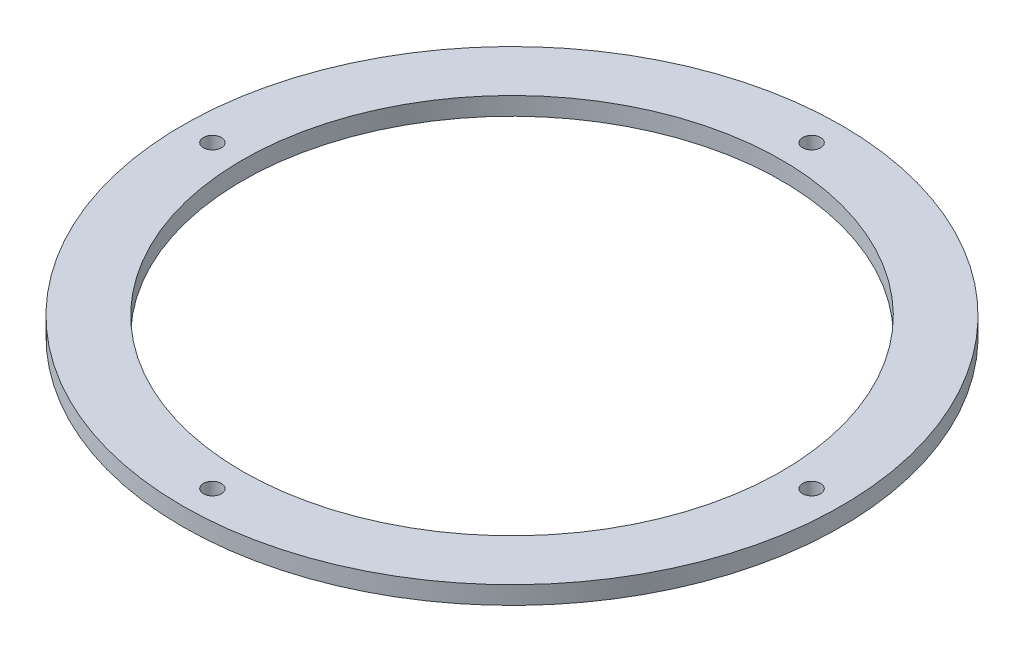
ISO-10303-21;
HEADER;
FILE_DESCRIPTION(('STEP AP214'),'2;1');
FILE_NAME('part.step','',(''),(''),'','','');
FILE_SCHEMA(('AUTOMOTIVE_DESIGN { 1 0 10303 214 1 1 1 1 }'));
ENDSEC;
DATA;
#1=APPLICATION_CONTEXT('core data for automotive mechanical design processes');
#2=APPLICATION_PROTOCOL_DEFINITION('international standard','automotive_design',2000,#1);
#3=PRODUCT_CONTEXT('',#1,'mechanical');
#4=PRODUCT('Part','Part','',(#3));
#5=PRODUCT_RELATED_PRODUCT_CATEGORY('part','',(#4));
#6=PRODUCT_DEFINITION_FORMATION('','',#4);
#7=PRODUCT_DEFINITION_CONTEXT('part definition',#1,'design');
#8=PRODUCT_DEFINITION('design','',#6,#7);
#9=PRODUCT_DEFINITION_SHAPE('','',#8);
#10=(LENGTH_UNIT() NAMED_UNIT(*) SI_UNIT(.MILLI.,.METRE.));
#11=(NAMED_UNIT(*) PLANE_ANGLE_UNIT() SI_UNIT($,.RADIAN.));
#12=(NAMED_UNIT(*) SI_UNIT($,.STERADIAN.) SOLID_ANGLE_UNIT());
#13=UNCERTAINTY_MEASURE_WITH_UNIT(LENGTH_MEASURE(1.E-05),#10,'distance_accuracy_value','');
#14=(GEOMETRIC_REPRESENTATION_CONTEXT(3) GLOBAL_UNCERTAINTY_ASSIGNED_CONTEXT((#13)) GLOBAL_UNIT_ASSIGNED_CONTEXT((#10,
#11,#12)) REPRESENTATION_CONTEXT('',''));
#15=CARTESIAN_POINT('',(0.,0.,0.));
#16=DIRECTION('',(0.,0.,1.));
#17=DIRECTION('',(1.,0.,0.));
#18=AXIS2_PLACEMENT_3D('',#15,#16,#17);
#19=CARTESIAN_POINT('',(0.,3.,0.));
#20=DIRECTION('',(0.,1.,0.));
#21=DIRECTION('',(0.,0.,1.));
#22=AXIS2_PLACEMENT_3D('',#19,#20,#21);
#23=PLANE('',#22);
#24=CARTESIAN_POINT('',(-50.,3.,0.));
#25=DIRECTION('',(0.,1.,0.));
#26=DIRECTION('',(0.,0.,1.));
#27=AXIS2_PLACEMENT_3D('',#24,#25,#26);
#28=CIRCLE('',#27,1.5);
#29=CARTESIAN_POINT('',(-50.,3.,1.5));
#30=VERTEX_POINT('',#29);
#31=EDGE_CURVE('E67',#30,#30,#28,.T.);
#32=ORIENTED_EDGE('',*,*,#31,.F.);
#33=EDGE_LOOP('',(#32));
#34=FACE_BOUND('',#33,.T.);
#35=CARTESIAN_POINT('',(0.,3.,50.));
#36=DIRECTION('',(0.,1.,0.));
#37=DIRECTION('',(0.,0.,1.));
#38=AXIS2_PLACEMENT_3D('',#35,#36,#37);
#39=CIRCLE('',#38,1.5);
#40=CARTESIAN_POINT('',(0.,3.,51.5));
#41=VERTEX_POINT('',#40);
#42=EDGE_CURVE('E61',#41,#41,#39,.T.);
#43=ORIENTED_EDGE('',*,*,#42,.F.);
#44=EDGE_LOOP('',(#43));
#45=FACE_BOUND('',#44,.T.);
#46=CARTESIAN_POINT('',(50.,3.,0.));
#47=DIRECTION('',(0.,1.,0.));
#48=DIRECTION('',(0.,0.,1.));
#49=AXIS2_PLACEMENT_3D('',#46,#47,#48);
#50=CIRCLE('',#49,1.5);
#51=CARTESIAN_POINT('',(50.,3.,1.5));
#52=VERTEX_POINT('',#51);
#53=EDGE_CURVE('E55',#52,#52,#50,.T.);
#54=ORIENTED_EDGE('',*,*,#53,.F.);
#55=EDGE_LOOP('',(#54));
#56=FACE_BOUND('',#55,.T.);
#57=CARTESIAN_POINT('',(0.,3.,-50.));
#58=DIRECTION('',(0.,1.,0.));
#59=DIRECTION('',(0.,0.,1.));
#60=AXIS2_PLACEMENT_3D('',#57,#58,#59);
#61=CIRCLE('',#60,1.5);
#62=CARTESIAN_POINT('',(0.,3.,-48.5));
#63=VERTEX_POINT('',#62);
#64=EDGE_CURVE('E49',#63,#63,#61,.T.);
#65=ORIENTED_EDGE('',*,*,#64,.F.);
#66=EDGE_LOOP('',(#65));
#67=FACE_BOUND('',#66,.T.);
#68=CARTESIAN_POINT('',(0.,3.,0.));
#69=DIRECTION('',(0.,1.,0.));
#70=DIRECTION('',(0.,0.,1.));
#71=AXIS2_PLACEMENT_3D('',#68,#69,#70);
#72=CIRCLE('',#71,55.);
#73=CARTESIAN_POINT('',(0.,3.,55.));
#74=VERTEX_POINT('',#73);
#75=EDGE_CURVE('E10',#74,#74,#72,.T.);
#76=ORIENTED_EDGE('',*,*,#75,.T.);
#77=EDGE_LOOP('',(#76));
#78=FACE_BOUND('',#77,.T.);
#79=CARTESIAN_POINT('',(0.,3.,0.));
#80=DIRECTION('',(0.,1.,0.));
#81=DIRECTION('',(0.,0.,1.));
#82=AXIS2_PLACEMENT_3D('',#79,#80,#81);
#83=CIRCLE('',#82,45.);
#84=CARTESIAN_POINT('',(0.,3.,45.));
#85=VERTEX_POINT('',#84);
#86=EDGE_CURVE('E41',#85,#85,#83,.T.);
#87=ORIENTED_EDGE('',*,*,#86,.F.);
#88=EDGE_LOOP('',(#87));
#89=FACE_BOUND('',#88,.T.);
#90=ADVANCED_FACE('F30',(#34,#45,#56,#67,#78,#89),#23,.T.);
#91=CARTESIAN_POINT('',(0.,0.,0.));
#92=DIRECTION('',(0.,1.,0.));
#93=DIRECTION('',(0.,0.,1.));
#94=AXIS2_PLACEMENT_3D('',#91,#92,#93);
#95=PLANE('',#94);
#96=CARTESIAN_POINT('',(-50.,0.,0.));
#97=DIRECTION('',(0.,1.,0.));
#98=DIRECTION('',(0.,0.,1.));
#99=AXIS2_PLACEMENT_3D('',#96,#97,#98);
#100=CIRCLE('',#99,1.5);
#101=CARTESIAN_POINT('',(-50.,0.,1.5));
#102=VERTEX_POINT('',#101);
#103=EDGE_CURVE('E46',#102,#102,#100,.T.);
#104=ORIENTED_EDGE('',*,*,#103,.T.);
#105=EDGE_LOOP('',(#104));
#106=FACE_BOUND('',#105,.T.);
#107=CARTESIAN_POINT('',(0.,0.,50.));
#108=DIRECTION('',(0.,1.,0.));
#109=DIRECTION('',(0.,0.,1.));
#110=AXIS2_PLACEMENT_3D('',#107,#108,#109);
#111=CIRCLE('',#110,1.5);
#112=CARTESIAN_POINT('',(0.,0.,51.5));
#113=VERTEX_POINT('',#112);
#114=EDGE_CURVE('E64',#113,#113,#111,.T.);
#115=ORIENTED_EDGE('',*,*,#114,.T.);
#116=EDGE_LOOP('',(#115));
#117=FACE_BOUND('',#116,.T.);
#118=CARTESIAN_POINT('',(50.,0.,0.));
#119=DIRECTION('',(0.,1.,0.));
#120=DIRECTION('',(0.,0.,1.));
#121=AXIS2_PLACEMENT_3D('',#118,#119,#120);
#122=CIRCLE('',#121,1.5);
#123=CARTESIAN_POINT('',(50.,0.,1.5));
#124=VERTEX_POINT('',#123);
#125=EDGE_CURVE('E58',#124,#124,#122,.T.);
#126=ORIENTED_EDGE('',*,*,#125,.T.);
#127=EDGE_LOOP('',(#126));
#128=FACE_BOUND('',#127,.T.);
#129=CARTESIAN_POINT('',(0.,0.,-50.));
#130=DIRECTION('',(0.,1.,0.));
#131=DIRECTION('',(0.,0.,1.));
#132=AXIS2_PLACEMENT_3D('',#129,#130,#131);
#133=CIRCLE('',#132,1.5);
#134=CARTESIAN_POINT('',(0.,0.,-48.5));
#135=VERTEX_POINT('',#134);
#136=EDGE_CURVE('E52',#135,#135,#133,.T.);
#137=ORIENTED_EDGE('',*,*,#136,.T.);
#138=EDGE_LOOP('',(#137));
#139=FACE_BOUND('',#138,.T.);
#140=CARTESIAN_POINT('',(0.,0.,0.));
#141=DIRECTION('',(0.,1.,0.));
#142=DIRECTION('',(0.,0.,1.));
#143=AXIS2_PLACEMENT_3D('',#140,#141,#142);
#144=CIRCLE('',#143,55.);
#145=CARTESIAN_POINT('',(0.,0.,55.));
#146=VERTEX_POINT('',#145);
#147=EDGE_CURVE('E34',#146,#146,#144,.T.);
#148=ORIENTED_EDGE('',*,*,#147,.F.);
#149=EDGE_LOOP('',(#148));
#150=FACE_BOUND('',#149,.T.);
#151=CARTESIAN_POINT('',(0.,0.,0.));
#152=DIRECTION('',(0.,1.,0.));
#153=DIRECTION('',(0.,0.,1.));
#154=AXIS2_PLACEMENT_3D('',#151,#152,#153);
#155=CIRCLE('',#154,45.);
#156=CARTESIAN_POINT('',(0.,0.,45.));
#157=VERTEX_POINT('',#156);
#158=EDGE_CURVE('E43',#157,#157,#155,.T.);
#159=ORIENTED_EDGE('',*,*,#158,.T.);
#160=EDGE_LOOP('',(#159));
#161=FACE_BOUND('',#160,.T.);
#162=ADVANCED_FACE('F73',(#106,#117,#128,#139,#150,#161),#95,.F.);
#163=CARTESIAN_POINT('',(0.,3.,0.));
#164=DIRECTION('',(0.,-1.,0.));
#165=DIRECTION('',(0.,0.,-1.));
#166=AXIS2_PLACEMENT_3D('',#163,#164,#165);
#167=CYLINDRICAL_SURFACE('',#166,55.);
#168=ORIENTED_EDGE('',*,*,#75,.F.);
#169=EDGE_LOOP('',(#168));
#170=FACE_BOUND('',#169,.T.);
#171=ORIENTED_EDGE('',*,*,#147,.T.);
#172=EDGE_LOOP('',(#171));
#173=FACE_BOUND('',#172,.T.);
#174=ADVANCED_FACE('F32',(#170,#173),#167,.T.);
#175=CARTESIAN_POINT('',(0.,3.,0.));
#176=DIRECTION('',(0.,-1.,0.));
#177=DIRECTION('',(0.,0.,-1.));
#178=AXIS2_PLACEMENT_3D('',#175,#176,#177);
#179=CYLINDRICAL_SURFACE('',#178,45.);
#180=ORIENTED_EDGE('',*,*,#86,.T.);
#181=EDGE_LOOP('',(#180));
#182=FACE_BOUND('',#181,.T.);
#183=ORIENTED_EDGE('',*,*,#158,.F.);
#184=EDGE_LOOP('',(#183));
#185=FACE_BOUND('',#184,.T.);
#186=ADVANCED_FACE('F94',(#182,#185),#179,.F.);
#187=CARTESIAN_POINT('',(0.,0.,-50.));
#188=DIRECTION('',(0.,1.,0.));
#189=DIRECTION('',(0.,0.,1.));
#190=AXIS2_PLACEMENT_3D('',#187,#188,#189);
#191=CYLINDRICAL_SURFACE('',#190,1.5);
#192=ORIENTED_EDGE('',*,*,#136,.F.);
#193=EDGE_LOOP('',(#192));
#194=FACE_BOUND('',#193,.T.);
#195=ORIENTED_EDGE('',*,*,#64,.T.);
#196=EDGE_LOOP('',(#195));
#197=FACE_BOUND('',#196,.T.);
#198=ADVANCED_FACE('F97',(#194,#197),#191,.F.);
#199=CARTESIAN_POINT('',(50.,0.,0.));
#200=DIRECTION('',(0.,1.,0.));
#201=DIRECTION('',(0.,0.,1.));
#202=AXIS2_PLACEMENT_3D('',#199,#200,#201);
#203=CYLINDRICAL_SURFACE('',#202,1.5);
#204=ORIENTED_EDGE('',*,*,#125,.F.);
#205=EDGE_LOOP('',(#204));
#206=FACE_BOUND('',#205,.T.);
#207=ORIENTED_EDGE('',*,*,#53,.T.);
#208=EDGE_LOOP('',(#207));
#209=FACE_BOUND('',#208,.T.);
#210=ADVANCED_FACE('F109',(#206,#209),#203,.F.);
#211=CARTESIAN_POINT('',(0.,0.,50.));
#212=DIRECTION('',(0.,1.,0.));
#213=DIRECTION('',(0.,0.,1.));
#214=AXIS2_PLACEMENT_3D('',#211,#212,#213);
#215=CYLINDRICAL_SURFACE('',#214,1.5);
#216=ORIENTED_EDGE('',*,*,#114,.F.);
#217=EDGE_LOOP('',(#216));
#218=FACE_BOUND('',#217,.T.);
#219=ORIENTED_EDGE('',*,*,#42,.T.);
#220=EDGE_LOOP('',(#219));
#221=FACE_BOUND('',#220,.T.);
#222=ADVANCED_FACE('F79',(#218,#221),#215,.F.);
#223=CARTESIAN_POINT('',(-50.,0.,0.));
#224=DIRECTION('',(0.,1.,0.));
#225=DIRECTION('',(0.,0.,1.));
#226=AXIS2_PLACEMENT_3D('',#223,#224,#225);
#227=CYLINDRICAL_SURFACE('',#226,1.5);
#228=ORIENTED_EDGE('',*,*,#103,.F.);
#229=EDGE_LOOP('',(#228));
#230=FACE_BOUND('',#229,.T.);
#231=ORIENTED_EDGE('',*,*,#31,.T.);
#232=EDGE_LOOP('',(#231));
#233=FACE_BOUND('',#232,.T.);
#234=ADVANCED_FACE('F76',(#230,#233),#227,.F.);
#235=CLOSED_SHELL('',(#90,#162,#174,#186,#198,#210,#222,#234));
#236=MANIFOLD_SOLID_BREP('B2',#235);
#237=ADVANCED_BREP_SHAPE_REPRESENTATION('',(#18,#236),#14);
#238=SHAPE_DEFINITION_REPRESENTATION(#9,#237);
ENDSEC;
END-ISO-10303-21;
